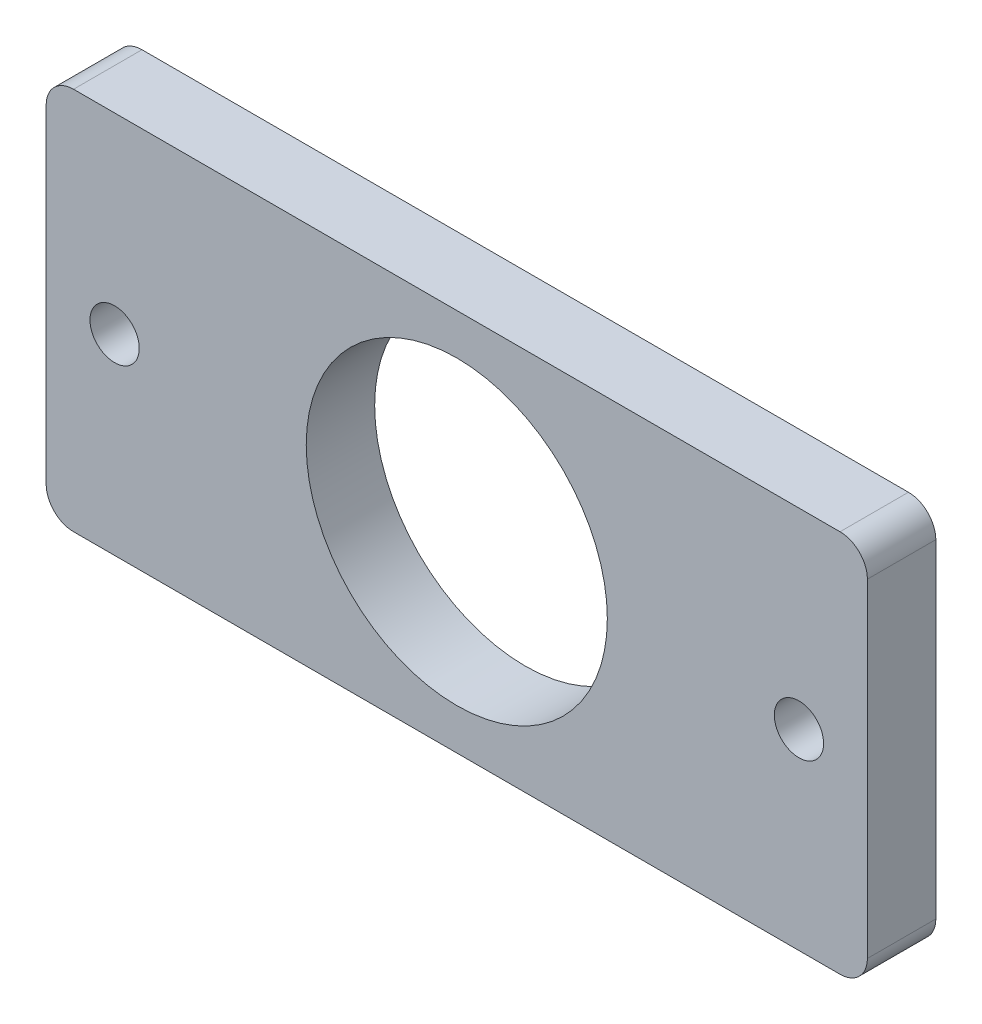
ISO-10303-21;
HEADER;
FILE_DESCRIPTION(('STEP AP214'),'2;1');
FILE_NAME('part.step','',(''),(''),'','','');
FILE_SCHEMA(('AUTOMOTIVE_DESIGN { 1 0 10303 214 1 1 1 1 }'));
ENDSEC;
DATA;
#1=APPLICATION_CONTEXT('core data for automotive mechanical design processes');
#2=APPLICATION_PROTOCOL_DEFINITION('international standard','automotive_design',2000,#1);
#3=PRODUCT_CONTEXT('',#1,'mechanical');
#4=PRODUCT('Part','Part','',(#3));
#5=PRODUCT_RELATED_PRODUCT_CATEGORY('part','',(#4));
#6=PRODUCT_DEFINITION_FORMATION('','',#4);
#7=PRODUCT_DEFINITION_CONTEXT('part definition',#1,'design');
#8=PRODUCT_DEFINITION('design','',#6,#7);
#9=PRODUCT_DEFINITION_SHAPE('','',#8);
#10=(LENGTH_UNIT() NAMED_UNIT(*) SI_UNIT(.MILLI.,.METRE.));
#11=(NAMED_UNIT(*) PLANE_ANGLE_UNIT() SI_UNIT($,.RADIAN.));
#12=(NAMED_UNIT(*) SI_UNIT($,.STERADIAN.) SOLID_ANGLE_UNIT());
#13=UNCERTAINTY_MEASURE_WITH_UNIT(LENGTH_MEASURE(1.E-05),#10,'distance_accuracy_value','');
#14=(GEOMETRIC_REPRESENTATION_CONTEXT(3) GLOBAL_UNCERTAINTY_ASSIGNED_CONTEXT((#13)) GLOBAL_UNIT_ASSIGNED_CONTEXT((#10,
#11,#12)) REPRESENTATION_CONTEXT('',''));
#15=CARTESIAN_POINT('',(0.,0.,0.));
#16=DIRECTION('',(0.,0.,1.));
#17=DIRECTION('',(1.,0.,0.));
#18=AXIS2_PLACEMENT_3D('',#15,#16,#17);
#19=CARTESIAN_POINT('',(0.,0.,75.049609375));
#20=DIRECTION('',(0.,0.,1.));
#21=DIRECTION('',(1.,0.,0.));
#22=AXIS2_PLACEMENT_3D('',#19,#20,#21);
#23=PLANE('',#22);
#24=CARTESIAN_POINT('',(11.8375,38.1,75.049609375));
#25=DIRECTION('',(0.,0.,1.));
#26=DIRECTION('',(1.,0.,0.));
#27=AXIS2_PLACEMENT_3D('',#24,#25,#26);
#28=CIRCLE('',#27,1.79999999999999);
#29=CARTESIAN_POINT('',(13.6375,38.1,75.049609375));
#30=VERTEX_POINT('',#29);
#31=EDGE_CURVE('E335',#30,#30,#28,.T.);
#32=ORIENTED_EDGE('',*,*,#31,.F.);
#33=EDGE_LOOP('',(#32));
#34=FACE_BOUND('',#33,.T.);
#35=CARTESIAN_POINT('',(61.8375,38.1,75.049609375));
#36=DIRECTION('',(0.,0.,1.));
#37=DIRECTION('',(1.,0.,0.));
#38=AXIS2_PLACEMENT_3D('',#35,#36,#37);
#39=CIRCLE('',#38,1.79999999999999);
#40=CARTESIAN_POINT('',(63.6375,38.1,75.049609375));
#41=VERTEX_POINT('',#40);
#42=EDGE_CURVE('E325',#41,#41,#39,.T.);
#43=ORIENTED_EDGE('',*,*,#42,.F.);
#44=EDGE_LOOP('',(#43));
#45=FACE_BOUND('',#44,.T.);
#46=DIRECTION('',(0.,-1.,0.));
#47=VECTOR('',#46,1.);
#48=CARTESIAN_POINT('',(66.8375,52.1,75.049609375));
#49=LINE('',#48,#47);
#50=CARTESIAN_POINT('',(66.8375,50.1,75.049609375));
#51=VERTEX_POINT('',#50);
#52=CARTESIAN_POINT('',(66.8375,26.1,75.049609375));
#53=VERTEX_POINT('',#52);
#54=EDGE_CURVE('E149',#51,#53,#49,.T.);
#55=ORIENTED_EDGE('',*,*,#54,.F.);
#56=CARTESIAN_POINT('',(64.8375,50.1,75.049609375));
#57=DIRECTION('',(0.,0.,1.));
#58=DIRECTION('',(1.,0.,0.));
#59=AXIS2_PLACEMENT_3D('',#56,#57,#58);
#60=CIRCLE('',#59,2.);
#61=CARTESIAN_POINT('',(64.8375,52.1,75.049609375));
#62=VERTEX_POINT('',#61);
#63=EDGE_CURVE('E167',#51,#62,#60,.T.);
#64=ORIENTED_EDGE('',*,*,#63,.T.);
#65=DIRECTION('',(1.,0.,0.));
#66=VECTOR('',#65,1.);
#67=CARTESIAN_POINT('',(6.83750000000002,52.1,75.049609375));
#68=LINE('',#67,#66);
#69=CARTESIAN_POINT('',(8.83750000000002,52.1,75.049609375));
#70=VERTEX_POINT('',#69);
#71=EDGE_CURVE('E146',#70,#62,#68,.T.);
#72=ORIENTED_EDGE('',*,*,#71,.F.);
#73=CARTESIAN_POINT('',(8.83750000000002,50.1,75.049609375));
#74=DIRECTION('',(0.,0.,1.));
#75=DIRECTION('',(1.,0.,0.));
#76=AXIS2_PLACEMENT_3D('',#73,#74,#75);
#77=CIRCLE('',#76,2.);
#78=CARTESIAN_POINT('',(6.83750000000002,50.1,75.049609375));
#79=VERTEX_POINT('',#78);
#80=EDGE_CURVE('E145',#70,#79,#77,.T.);
#81=ORIENTED_EDGE('',*,*,#80,.T.);
#82=DIRECTION('',(0.,-1.,0.));
#83=VECTOR('',#82,1.);
#84=CARTESIAN_POINT('',(6.83750000000002,52.1,75.049609375));
#85=LINE('',#84,#83);
#86=CARTESIAN_POINT('',(6.83750000000002,26.1,75.049609375));
#87=VERTEX_POINT('',#86);
#88=EDGE_CURVE('E141',#79,#87,#85,.T.);
#89=ORIENTED_EDGE('',*,*,#88,.T.);
#90=CARTESIAN_POINT('',(8.83750000000002,26.1,75.049609375));
#91=DIRECTION('',(0.,0.,1.));
#92=DIRECTION('',(1.,0.,0.));
#93=AXIS2_PLACEMENT_3D('',#90,#91,#92);
#94=CIRCLE('',#93,2.);
#95=CARTESIAN_POINT('',(8.83750000000002,24.1,75.049609375));
#96=VERTEX_POINT('',#95);
#97=EDGE_CURVE('E76',#87,#96,#94,.T.);
#98=ORIENTED_EDGE('',*,*,#97,.T.);
#99=DIRECTION('',(1.,0.,0.));
#100=VECTOR('',#99,1.);
#101=CARTESIAN_POINT('',(6.83750000000002,24.1,75.049609375));
#102=LINE('',#101,#100);
#103=CARTESIAN_POINT('',(64.8375,24.1,75.049609375));
#104=VERTEX_POINT('',#103);
#105=EDGE_CURVE('E176',#96,#104,#102,.T.);
#106=ORIENTED_EDGE('',*,*,#105,.T.);
#107=CARTESIAN_POINT('',(64.8375,26.1,75.049609375));
#108=DIRECTION('',(0.,0.,1.));
#109=DIRECTION('',(1.,0.,0.));
#110=AXIS2_PLACEMENT_3D('',#107,#108,#109);
#111=CIRCLE('',#110,2.);
#112=EDGE_CURVE('E165',#104,#53,#111,.T.);
#113=ORIENTED_EDGE('',*,*,#112,.T.);
#114=EDGE_LOOP('',(#55,#64,#72,#81,#89,#98,#106,#113));
#115=FACE_BOUND('',#114,.T.);
#116=CARTESIAN_POINT('',(36.8375,38.1,75.049609375));
#117=DIRECTION('',(0.,0.,1.));
#118=DIRECTION('',(1.,0.,0.));
#119=AXIS2_PLACEMENT_3D('',#116,#117,#118);
#120=CIRCLE('',#119,11.);
#121=CARTESIAN_POINT('',(47.8375,38.1,75.049609375));
#122=VERTEX_POINT('',#121);
#123=EDGE_CURVE('E187',#122,#122,#120,.T.);
#124=ORIENTED_EDGE('',*,*,#123,.F.);
#125=EDGE_LOOP('',(#124));
#126=FACE_BOUND('',#125,.T.);
#127=ADVANCED_FACE('F54',(#34,#45,#115,#126),#23,.T.);
#128=CARTESIAN_POINT('',(0.,0.,70.049609375));
#129=DIRECTION('',(0.,0.,1.));
#130=DIRECTION('',(1.,0.,0.));
#131=AXIS2_PLACEMENT_3D('',#128,#129,#130);
#132=PLANE('',#131);
#133=CARTESIAN_POINT('',(11.8375,38.1,70.049609375));
#134=DIRECTION('',(0.,0.,1.));
#135=DIRECTION('',(1.,0.,0.));
#136=AXIS2_PLACEMENT_3D('',#133,#134,#135);
#137=CIRCLE('',#136,1.79999999999999);
#138=CARTESIAN_POINT('',(13.6375,38.1,70.049609375));
#139=VERTEX_POINT('',#138);
#140=EDGE_CURVE('E330',#139,#139,#137,.T.);
#141=ORIENTED_EDGE('',*,*,#140,.T.);
#142=EDGE_LOOP('',(#141));
#143=FACE_BOUND('',#142,.T.);
#144=CARTESIAN_POINT('',(61.8375,38.1,70.049609375));
#145=DIRECTION('',(0.,0.,1.));
#146=DIRECTION('',(1.,0.,0.));
#147=AXIS2_PLACEMENT_3D('',#144,#145,#146);
#148=CIRCLE('',#147,1.8);
#149=CARTESIAN_POINT('',(63.6375,38.1,70.049609375));
#150=VERTEX_POINT('',#149);
#151=EDGE_CURVE('E323',#150,#150,#148,.T.);
#152=ORIENTED_EDGE('',*,*,#151,.T.);
#153=EDGE_LOOP('',(#152));
#154=FACE_BOUND('',#153,.T.);
#155=DIRECTION('',(1.,0.,0.));
#156=VECTOR('',#155,1.);
#157=CARTESIAN_POINT('',(6.83750000000002,52.1,70.049609375));
#158=LINE('',#157,#156);
#159=CARTESIAN_POINT('',(8.83750000000002,52.1,70.049609375));
#160=VERTEX_POINT('',#159);
#161=CARTESIAN_POINT('',(64.8375,52.1,70.049609375));
#162=VERTEX_POINT('',#161);
#163=EDGE_CURVE('E124',#160,#162,#158,.T.);
#164=ORIENTED_EDGE('',*,*,#163,.T.);
#165=CARTESIAN_POINT('',(64.8375,50.1,70.049609375));
#166=DIRECTION('',(0.,0.,1.));
#167=DIRECTION('',(1.,0.,0.));
#168=AXIS2_PLACEMENT_3D('',#165,#166,#167);
#169=CIRCLE('',#168,2.);
#170=CARTESIAN_POINT('',(66.8375,50.1,70.049609375));
#171=VERTEX_POINT('',#170);
#172=EDGE_CURVE('E156',#162,#171,#169,.F.);
#173=ORIENTED_EDGE('',*,*,#172,.T.);
#174=DIRECTION('',(0.,-1.,0.));
#175=VECTOR('',#174,1.);
#176=CARTESIAN_POINT('',(66.8375,52.1,70.049609375));
#177=LINE('',#176,#175);
#178=CARTESIAN_POINT('',(66.8375,26.1,70.049609375));
#179=VERTEX_POINT('',#178);
#180=EDGE_CURVE('E142',#171,#179,#177,.T.);
#181=ORIENTED_EDGE('',*,*,#180,.T.);
#182=CARTESIAN_POINT('',(64.8375,26.1,70.049609375));
#183=DIRECTION('',(0.,0.,1.));
#184=DIRECTION('',(1.,0.,0.));
#185=AXIS2_PLACEMENT_3D('',#182,#183,#184);
#186=CIRCLE('',#185,2.);
#187=CARTESIAN_POINT('',(64.8375,24.1,70.049609375));
#188=VERTEX_POINT('',#187);
#189=EDGE_CURVE('E154',#179,#188,#186,.F.);
#190=ORIENTED_EDGE('',*,*,#189,.T.);
#191=DIRECTION('',(1.,0.,0.));
#192=VECTOR('',#191,1.);
#193=CARTESIAN_POINT('',(6.83750000000002,24.1,70.049609375));
#194=LINE('',#193,#192);
#195=CARTESIAN_POINT('',(8.83750000000002,24.1,70.049609375));
#196=VERTEX_POINT('',#195);
#197=EDGE_CURVE('E186',#196,#188,#194,.T.);
#198=ORIENTED_EDGE('',*,*,#197,.F.);
#199=CARTESIAN_POINT('',(8.83750000000002,26.1,70.049609375));
#200=DIRECTION('',(0.,0.,1.));
#201=DIRECTION('',(1.,0.,0.));
#202=AXIS2_PLACEMENT_3D('',#199,#200,#201);
#203=CIRCLE('',#202,2.);
#204=CARTESIAN_POINT('',(6.83750000000002,26.1,70.049609375));
#205=VERTEX_POINT('',#204);
#206=EDGE_CURVE('E131',#196,#205,#203,.F.);
#207=ORIENTED_EDGE('',*,*,#206,.T.);
#208=DIRECTION('',(0.,-1.,0.));
#209=VECTOR('',#208,1.);
#210=CARTESIAN_POINT('',(6.83750000000002,52.1,70.049609375));
#211=LINE('',#210,#209);
#212=CARTESIAN_POINT('',(6.83750000000002,50.1,70.049609375));
#213=VERTEX_POINT('',#212);
#214=EDGE_CURVE('E126',#213,#205,#211,.T.);
#215=ORIENTED_EDGE('',*,*,#214,.F.);
#216=CARTESIAN_POINT('',(8.83750000000002,50.1,70.049609375));
#217=DIRECTION('',(0.,0.,1.));
#218=DIRECTION('',(1.,0.,0.));
#219=AXIS2_PLACEMENT_3D('',#216,#217,#218);
#220=CIRCLE('',#219,2.);
#221=EDGE_CURVE('E120',#213,#160,#220,.F.);
#222=ORIENTED_EDGE('',*,*,#221,.T.);
#223=EDGE_LOOP('',(#164,#173,#181,#190,#198,#207,#215,#222));
#224=FACE_BOUND('',#223,.T.);
#225=CARTESIAN_POINT('',(36.8375,38.1,70.049609375));
#226=DIRECTION('',(0.,0.,1.));
#227=DIRECTION('',(1.,0.,0.));
#228=AXIS2_PLACEMENT_3D('',#225,#226,#227);
#229=CIRCLE('',#228,11.);
#230=CARTESIAN_POINT('',(47.8375,38.1,70.049609375));
#231=VERTEX_POINT('',#230);
#232=EDGE_CURVE('E180',#231,#231,#229,.T.);
#233=ORIENTED_EDGE('',*,*,#232,.T.);
#234=EDGE_LOOP('',(#233));
#235=FACE_BOUND('',#234,.T.);
#236=ADVANCED_FACE('F122',(#143,#154,#224,#235),#132,.F.);
#237=CARTESIAN_POINT('',(6.83750000000002,52.1,75.049609375));
#238=DIRECTION('',(1.,0.,0.));
#239=DIRECTION('',(0.,0.,-1.));
#240=AXIS2_PLACEMENT_3D('',#237,#238,#239);
#241=PLANE('',#240);
#242=ORIENTED_EDGE('',*,*,#214,.T.);
#243=DIRECTION('',(0.,0.,-1.));
#244=VECTOR('',#243,1.);
#245=CARTESIAN_POINT('',(6.83750000000002,26.1,75.049609375));
#246=LINE('',#245,#244);
#247=EDGE_CURVE('E12',#205,#87,#246,.F.);
#248=ORIENTED_EDGE('',*,*,#247,.T.);
#249=ORIENTED_EDGE('',*,*,#88,.F.);
#250=DIRECTION('',(0.,0.,-1.));
#251=VECTOR('',#250,1.);
#252=CARTESIAN_POINT('',(6.83750000000002,50.1,70.049609375));
#253=LINE('',#252,#251);
#254=EDGE_CURVE('E62',#79,#213,#253,.T.);
#255=ORIENTED_EDGE('',*,*,#254,.T.);
#256=EDGE_LOOP('',(#242,#248,#249,#255));
#257=FACE_BOUND('',#256,.T.);
#258=ADVANCED_FACE('F174',(#257),#241,.F.);
#259=CARTESIAN_POINT('',(6.83750000000002,24.1,75.049609375));
#260=DIRECTION('',(0.,1.,0.));
#261=DIRECTION('',(-1.,0.,0.));
#262=AXIS2_PLACEMENT_3D('',#259,#260,#261);
#263=PLANE('',#262);
#264=ORIENTED_EDGE('',*,*,#197,.T.);
#265=DIRECTION('',(0.,0.,-1.));
#266=VECTOR('',#265,1.);
#267=CARTESIAN_POINT('',(64.8375,24.1,75.049609375));
#268=LINE('',#267,#266);
#269=EDGE_CURVE('E69',#188,#104,#268,.F.);
#270=ORIENTED_EDGE('',*,*,#269,.T.);
#271=ORIENTED_EDGE('',*,*,#105,.F.);
#272=DIRECTION('',(0.,0.,-1.));
#273=VECTOR('',#272,1.);
#274=CARTESIAN_POINT('',(8.83750000000002,24.1,75.049609375));
#275=LINE('',#274,#273);
#276=EDGE_CURVE('E169',#96,#196,#275,.T.);
#277=ORIENTED_EDGE('',*,*,#276,.T.);
#278=EDGE_LOOP('',(#264,#270,#271,#277));
#279=FACE_BOUND('',#278,.T.);
#280=ADVANCED_FACE('F232',(#279),#263,.F.);
#281=CARTESIAN_POINT('',(66.8375,52.1,75.049609375));
#282=DIRECTION('',(1.,0.,0.));
#283=DIRECTION('',(0.,0.,-1.));
#284=AXIS2_PLACEMENT_3D('',#281,#282,#283);
#285=PLANE('',#284);
#286=ORIENTED_EDGE('',*,*,#180,.F.);
#287=DIRECTION('',(0.,0.,-1.));
#288=VECTOR('',#287,1.);
#289=CARTESIAN_POINT('',(66.8375,50.1,75.049609375));
#290=LINE('',#289,#288);
#291=EDGE_CURVE('E161',#171,#51,#290,.F.);
#292=ORIENTED_EDGE('',*,*,#291,.T.);
#293=ORIENTED_EDGE('',*,*,#54,.T.);
#294=DIRECTION('',(0.,0.,-1.));
#295=VECTOR('',#294,1.);
#296=CARTESIAN_POINT('',(66.8375,26.1,70.049609375));
#297=LINE('',#296,#295);
#298=EDGE_CURVE('E158',#53,#179,#297,.T.);
#299=ORIENTED_EDGE('',*,*,#298,.T.);
#300=EDGE_LOOP('',(#286,#292,#293,#299));
#301=FACE_BOUND('',#300,.T.);
#302=ADVANCED_FACE('F193',(#301),#285,.T.);
#303=CARTESIAN_POINT('',(6.83750000000002,52.1,75.049609375));
#304=DIRECTION('',(0.,1.,0.));
#305=DIRECTION('',(-1.,0.,0.));
#306=AXIS2_PLACEMENT_3D('',#303,#304,#305);
#307=PLANE('',#306);
#308=ORIENTED_EDGE('',*,*,#71,.T.);
#309=DIRECTION('',(0.,0.,-1.));
#310=VECTOR('',#309,1.);
#311=CARTESIAN_POINT('',(64.8375,52.1,75.049609375));
#312=LINE('',#311,#310);
#313=EDGE_CURVE('E132',#62,#162,#312,.T.);
#314=ORIENTED_EDGE('',*,*,#313,.T.);
#315=ORIENTED_EDGE('',*,*,#163,.F.);
#316=DIRECTION('',(0.,0.,-1.));
#317=VECTOR('',#316,1.);
#318=CARTESIAN_POINT('',(8.83750000000002,52.1,75.049609375));
#319=LINE('',#318,#317);
#320=EDGE_CURVE('E138',#160,#70,#319,.F.);
#321=ORIENTED_EDGE('',*,*,#320,.T.);
#322=EDGE_LOOP('',(#308,#314,#315,#321));
#323=FACE_BOUND('',#322,.T.);
#324=ADVANCED_FACE('F137',(#323),#307,.T.);
#325=CARTESIAN_POINT('',(36.8375,38.1,75.049609375));
#326=DIRECTION('',(0.,0.,-1.));
#327=DIRECTION('',(-1.,0.,0.));
#328=AXIS2_PLACEMENT_3D('',#325,#326,#327);
#329=CYLINDRICAL_SURFACE('',#328,11.);
#330=ORIENTED_EDGE('',*,*,#123,.T.);
#331=EDGE_LOOP('',(#330));
#332=FACE_BOUND('',#331,.T.);
#333=ORIENTED_EDGE('',*,*,#232,.F.);
#334=EDGE_LOOP('',(#333));
#335=FACE_BOUND('',#334,.T.);
#336=ADVANCED_FACE('F225',(#332,#335),#329,.F.);
#337=CARTESIAN_POINT('',(61.8375,38.1,75.049609375));
#338=DIRECTION('',(0.,0.,1.));
#339=DIRECTION('',(1.,0.,0.));
#340=AXIS2_PLACEMENT_3D('',#337,#338,#339);
#341=CYLINDRICAL_SURFACE('',#340,1.8);
#342=ORIENTED_EDGE('',*,*,#151,.F.);
#343=EDGE_LOOP('',(#342));
#344=FACE_BOUND('',#343,.T.);
#345=ORIENTED_EDGE('',*,*,#42,.T.);
#346=EDGE_LOOP('',(#345));
#347=FACE_BOUND('',#346,.T.);
#348=ADVANCED_FACE('F287',(#344,#347),#341,.F.);
#349=CARTESIAN_POINT('',(11.8375,38.1,75.049609375));
#350=DIRECTION('',(0.,0.,1.));
#351=DIRECTION('',(1.,0.,0.));
#352=AXIS2_PLACEMENT_3D('',#349,#350,#351);
#353=CYLINDRICAL_SURFACE('',#352,1.79999999999999);
#354=ORIENTED_EDGE('',*,*,#140,.F.);
#355=EDGE_LOOP('',(#354));
#356=FACE_BOUND('',#355,.T.);
#357=ORIENTED_EDGE('',*,*,#31,.T.);
#358=EDGE_LOOP('',(#357));
#359=FACE_BOUND('',#358,.T.);
#360=ADVANCED_FACE('F211',(#356,#359),#353,.F.);
#361=CARTESIAN_POINT('',(64.8375,50.1,75.049609375));
#362=DIRECTION('',(0.,0.,-1.));
#363=DIRECTION('',(-1.,0.,0.));
#364=AXIS2_PLACEMENT_3D('',#361,#362,#363);
#365=CYLINDRICAL_SURFACE('',#364,2.);
#366=ORIENTED_EDGE('',*,*,#63,.F.);
#367=ORIENTED_EDGE('',*,*,#291,.F.);
#368=ORIENTED_EDGE('',*,*,#172,.F.);
#369=ORIENTED_EDGE('',*,*,#313,.F.);
#370=EDGE_LOOP('',(#366,#367,#368,#369));
#371=FACE_BOUND('',#370,.T.);
#372=ADVANCED_FACE('F198',(#371),#365,.T.);
#373=CARTESIAN_POINT('',(64.8375,26.1,75.049609375));
#374=DIRECTION('',(0.,0.,1.));
#375=DIRECTION('',(1.,0.,0.));
#376=AXIS2_PLACEMENT_3D('',#373,#374,#375);
#377=CYLINDRICAL_SURFACE('',#376,2.);
#378=ORIENTED_EDGE('',*,*,#112,.F.);
#379=ORIENTED_EDGE('',*,*,#269,.F.);
#380=ORIENTED_EDGE('',*,*,#189,.F.);
#381=ORIENTED_EDGE('',*,*,#298,.F.);
#382=EDGE_LOOP('',(#378,#379,#380,#381));
#383=FACE_BOUND('',#382,.T.);
#384=ADVANCED_FACE('F202',(#383),#377,.T.);
#385=CARTESIAN_POINT('',(8.83750000000002,26.1,75.049609375));
#386=DIRECTION('',(0.,0.,-1.));
#387=DIRECTION('',(-1.,0.,0.));
#388=AXIS2_PLACEMENT_3D('',#385,#386,#387);
#389=CYLINDRICAL_SURFACE('',#388,2.);
#390=ORIENTED_EDGE('',*,*,#97,.F.);
#391=ORIENTED_EDGE('',*,*,#247,.F.);
#392=ORIENTED_EDGE('',*,*,#206,.F.);
#393=ORIENTED_EDGE('',*,*,#276,.F.);
#394=EDGE_LOOP('',(#390,#391,#392,#393));
#395=FACE_BOUND('',#394,.T.);
#396=ADVANCED_FACE('F204',(#395),#389,.T.);
#397=CARTESIAN_POINT('',(8.83750000000002,50.1,75.049609375));
#398=DIRECTION('',(0.,0.,1.));
#399=DIRECTION('',(1.,0.,0.));
#400=AXIS2_PLACEMENT_3D('',#397,#398,#399);
#401=CYLINDRICAL_SURFACE('',#400,2.);
#402=ORIENTED_EDGE('',*,*,#80,.F.);
#403=ORIENTED_EDGE('',*,*,#320,.F.);
#404=ORIENTED_EDGE('',*,*,#221,.F.);
#405=ORIENTED_EDGE('',*,*,#254,.F.);
#406=EDGE_LOOP('',(#402,#403,#404,#405));
#407=FACE_BOUND('',#406,.T.);
#408=ADVANCED_FACE('F56',(#407),#401,.T.);
#409=CLOSED_SHELL('',(#127,#236,#258,#280,#302,#324,#336,#348,#360,#372,#384,#396,#408));
#410=MANIFOLD_SOLID_BREP('B2',#409);
#411=ADVANCED_BREP_SHAPE_REPRESENTATION('',(#18,#410),#14);
#412=SHAPE_DEFINITION_REPRESENTATION(#9,#411);
ENDSEC;
END-ISO-10303-21;
